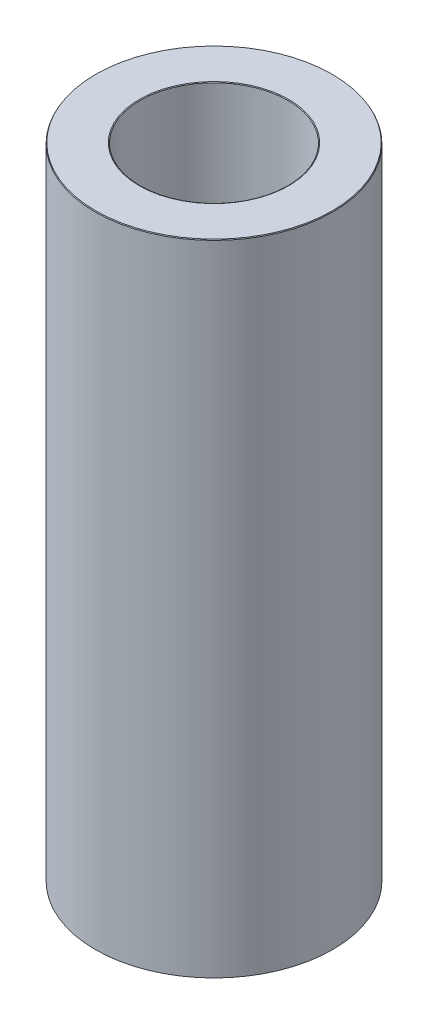
ISO-10303-21;
HEADER;
FILE_DESCRIPTION(('STEP AP214'),'2;1');
FILE_NAME('part.step','',(''),(''),'','','');
FILE_SCHEMA(('AUTOMOTIVE_DESIGN { 1 0 10303 214 1 1 1 1 }'));
ENDSEC;
DATA;
#1=APPLICATION_CONTEXT('core data for automotive mechanical design processes');
#2=APPLICATION_PROTOCOL_DEFINITION('international standard','automotive_design',2000,#1);
#3=PRODUCT_CONTEXT('',#1,'mechanical');
#4=PRODUCT('Part','Part','',(#3));
#5=PRODUCT_RELATED_PRODUCT_CATEGORY('part','',(#4));
#6=PRODUCT_DEFINITION_FORMATION('','',#4);
#7=PRODUCT_DEFINITION_CONTEXT('part definition',#1,'design');
#8=PRODUCT_DEFINITION('design','',#6,#7);
#9=PRODUCT_DEFINITION_SHAPE('','',#8);
#10=(LENGTH_UNIT() NAMED_UNIT(*) SI_UNIT(.MILLI.,.METRE.));
#11=(NAMED_UNIT(*) PLANE_ANGLE_UNIT() SI_UNIT($,.RADIAN.));
#12=(NAMED_UNIT(*) SI_UNIT($,.STERADIAN.) SOLID_ANGLE_UNIT());
#13=UNCERTAINTY_MEASURE_WITH_UNIT(LENGTH_MEASURE(1.E-05),#10,'distance_accuracy_value','');
#14=(GEOMETRIC_REPRESENTATION_CONTEXT(3) GLOBAL_UNCERTAINTY_ASSIGNED_CONTEXT((#13)) GLOBAL_UNIT_ASSIGNED_CONTEXT((#10,
#11,#12)) REPRESENTATION_CONTEXT('',''));
#15=CARTESIAN_POINT('',(0.,0.,0.));
#16=DIRECTION('',(0.,0.,1.));
#17=DIRECTION('',(1.,0.,0.));
#18=AXIS2_PLACEMENT_3D('',#15,#16,#17);
#19=CARTESIAN_POINT('',(0.,215.604779690848,0.));
#20=DIRECTION('',(0.,-1.,0.));
#21=DIRECTION('',(0.,0.,-1.));
#22=AXIS2_PLACEMENT_3D('',#19,#20,#21);
#23=CYLINDRICAL_SURFACE('',#22,40.);
#24=CARTESIAN_POINT('',(0.,0.157871731963771,0.));
#25=DIRECTION('',(0.,1.,0.));
#26=DIRECTION('',(0.,0.,1.));
#27=AXIS2_PLACEMENT_3D('',#24,#25,#26);
#28=CIRCLE('',#27,40.);
#29=CARTESIAN_POINT('',(0.,0.157871731963743,-40.));
#30=VERTEX_POINT('',#29);
#31=EDGE_CURVE('E10',#30,#30,#28,.T.);
#32=CARTESIAN_POINT('',(0.,215.331337830009,0.));
#33=DIRECTION('',(0.,1.,0.));
#34=DIRECTION('',(0.,0.,1.));
#35=AXIS2_PLACEMENT_3D('',#32,#33,#34);
#36=CIRCLE('',#35,40.);
#37=CARTESIAN_POINT('',(0.,215.331337830009,-40.));
#38=VERTEX_POINT('',#37);
#39=EDGE_CURVE('E50',#38,#38,#36,.F.);
#40=CARTESIAN_POINT('',(0.,0.157871731963743,-40.));
#41=CARTESIAN_POINT('',(0.,2.39926200381838,-40.));
#42=CARTESIAN_POINT('',(0.,4.64065227567301,-40.));
#43=CARTESIAN_POINT('',(0.,9.12343281938227,-40.));
#44=CARTESIAN_POINT('',(0.,11.3648230912369,-40.));
#45=CARTESIAN_POINT('',(0.,15.8476036349462,-40.));
#46=CARTESIAN_POINT('',(0.,18.0889939068008,-40.));
#47=CARTESIAN_POINT('',(0.,22.5717744505101,-40.));
#48=CARTESIAN_POINT('',(0.,24.8131647223647,-40.));
#49=CARTESIAN_POINT('',(0.,29.295945266074,-40.));
#50=CARTESIAN_POINT('',(0.,31.5373355379286,-40.));
#51=CARTESIAN_POINT('',(0.,36.0201160816379,-40.));
#52=CARTESIAN_POINT('',(0.,38.2615063534925,-40.));
#53=CARTESIAN_POINT('',(0.,42.7442868972018,-40.));
#54=CARTESIAN_POINT('',(0.,44.9856771690564,-40.));
#55=CARTESIAN_POINT('',(0.,49.4684577127657,-40.));
#56=CARTESIAN_POINT('',(0.,51.7098479846203,-40.));
#57=CARTESIAN_POINT('',(0.,56.1926285283296,-40.));
#58=CARTESIAN_POINT('',(0.,58.4340188001842,-40.));
#59=CARTESIAN_POINT('',(0.,62.9167993438935,-40.));
#60=CARTESIAN_POINT('',(0.,65.1581896157481,-40.));
#61=CARTESIAN_POINT('',(0.,69.6409701594574,-40.));
#62=CARTESIAN_POINT('',(0.,71.882360431312,-40.));
#63=CARTESIAN_POINT('',(0.,76.3651409750213,-40.));
#64=CARTESIAN_POINT('',(0.,78.6065312468759,-40.));
#65=CARTESIAN_POINT('',(0.,83.0893117905852,-40.));
#66=CARTESIAN_POINT('',(0.,85.3307020624398,-40.));
#67=CARTESIAN_POINT('',(0.,89.8134826061491,-40.));
#68=CARTESIAN_POINT('',(0.,92.0548728780037,-40.));
#69=CARTESIAN_POINT('',(0.,96.537653421713,-40.));
#70=CARTESIAN_POINT('',(0.,98.7790436935676,-40.));
#71=CARTESIAN_POINT('',(0.,103.261824237277,-40.));
#72=CARTESIAN_POINT('',(0.,105.503214509132,-40.));
#73=CARTESIAN_POINT('',(0.,109.985995052841,-40.));
#74=CARTESIAN_POINT('',(0.,112.227385324695,-40.));
#75=CARTESIAN_POINT('',(0.,116.710165868405,-40.));
#76=CARTESIAN_POINT('',(0.,118.951556140259,-40.));
#77=CARTESIAN_POINT('',(0.,123.434336683969,-40.));
#78=CARTESIAN_POINT('',(0.,125.675726955823,-40.));
#79=CARTESIAN_POINT('',(0.,130.158507499532,-40.));
#80=CARTESIAN_POINT('',(0.,132.399897771387,-40.));
#81=CARTESIAN_POINT('',(0.,136.882678315096,-40.));
#82=CARTESIAN_POINT('',(0.,139.124068586951,-40.));
#83=CARTESIAN_POINT('',(0.,143.60684913066,-40.));
#84=CARTESIAN_POINT('',(0.,145.848239402515,-40.));
#85=CARTESIAN_POINT('',(0.,150.331019946224,-40.));
#86=CARTESIAN_POINT('',(0.,152.572410218079,-40.));
#87=CARTESIAN_POINT('',(0.,157.055190761788,-40.));
#88=CARTESIAN_POINT('',(0.,159.296581033643,-40.));
#89=CARTESIAN_POINT('',(0.,163.779361577352,-40.));
#90=CARTESIAN_POINT('',(0.,166.020751849207,-40.));
#91=CARTESIAN_POINT('',(0.,170.503532392916,-40.));
#92=CARTESIAN_POINT('',(0.,172.744922664771,-40.));
#93=CARTESIAN_POINT('',(0.,177.22770320848,-40.));
#94=CARTESIAN_POINT('',(0.,179.469093480334,-40.));
#95=CARTESIAN_POINT('',(0.,183.951874024044,-40.));
#96=CARTESIAN_POINT('',(0.,186.193264295898,-40.));
#97=CARTESIAN_POINT('',(0.,190.676044839608,-40.));
#98=CARTESIAN_POINT('',(0.,192.917435111462,-40.));
#99=CARTESIAN_POINT('',(0.,197.400215655171,-40.));
#100=CARTESIAN_POINT('',(0.,199.641605927026,-40.));
#101=CARTESIAN_POINT('',(0.,204.124386470735,-40.));
#102=CARTESIAN_POINT('',(0.,206.36577674259,-40.));
#103=CARTESIAN_POINT('',(0.,210.848557286299,-40.));
#104=CARTESIAN_POINT('',(0.,213.089947558154,-40.));
#105=CARTESIAN_POINT('',(0.,215.331337830009,-40.));
#106=B_SPLINE_CURVE_WITH_KNOTS('',3,(#40,#41,#42,#43,#44,#45,#46,#47,#48,#49,#50,#51,#52,#53,
#54,#55,#56,#57,#58,#59,#60,#61,#62,#63,#64,#65,#66,#67,#68,#69,#70,#71,#72,#73,#74,#75,#76,#77,
#78,#79,#80,#81,#82,#83,#84,#85,#86,#87,#88,#89,#90,#91,#92,#93,#94,#95,#96,#97,#98,#99,#100,
#101,#102,#103,#104,#105),.UNSPECIFIED.,.F.,.F.,(4,2,2,2,2,2,2,2,2,2,2,2,2,2,2,2,2,2,2,2,2,2,2,
2,2,2,2,2,2,2,2,2,4),(0.,6.7241708155639,13.4483416311278,20.1725124466917,26.8966832622556,
33.6208540778195,40.3450248933834,47.0691957089473,53.7933665245112,60.5175373400751,
67.241708155639,73.9658789712029,80.6900497867668,87.4142206023307,94.1383914178946,
100.862562233459,107.586733049022,114.310903864586,121.03507468015,127.759245495714,
134.483416311278,141.207587126842,147.931757942406,154.65592875797,161.380099573534,
168.104270389098,174.828441204661,181.552612020225,188.276782835789,195.000953651353,
201.725124466917,208.449295282481,215.173466098045),.UNSPECIFIED.);
#107=EDGE_CURVE('BSEAM39',#30,#38,#106,.T.);
#108=ORIENTED_EDGE('',*,*,#31,.T.);
#109=ORIENTED_EDGE('',*,*,#39,.T.);
#110=ORIENTED_EDGE('',*,*,#107,.T.);
#111=ORIENTED_EDGE('',*,*,#107,.F.);
#112=EDGE_LOOP('',(#108,#110,#109,#111));
#113=FACE_BOUND('',#112,.T.);
#114=ADVANCED_FACE('F39',(#113),#23,.T.);
#115=CARTESIAN_POINT('',(0.,215.604779690848,0.));
#116=DIRECTION('',(0.,1.,0.));
#117=DIRECTION('',(0.,0.,1.));
#118=AXIS2_PLACEMENT_3D('',#115,#116,#117);
#119=PLANE('',#118);
#120=CARTESIAN_POINT('',(0.,215.604779690848,0.));
#121=DIRECTION('',(0.,1.,0.));
#122=DIRECTION('',(0.,0.,1.));
#123=AXIS2_PLACEMENT_3D('',#120,#121,#122);
#124=CIRCLE('',#123,25.1826020037234);
#125=CARTESIAN_POINT('',(0.,215.604779690848,25.1826020037234));
#126=VERTEX_POINT('',#125);
#127=EDGE_CURVE('E58',#126,#126,#124,.F.);
#128=ORIENTED_EDGE('',*,*,#127,.T.);
#129=EDGE_LOOP('',(#128));
#130=FACE_BOUND('',#129,.T.);
#131=CARTESIAN_POINT('',(0.,215.604779690848,0.));
#132=DIRECTION('',(0.,1.,0.));
#133=DIRECTION('',(0.,0.,1.));
#134=AXIS2_PLACEMENT_3D('',#131,#132,#133);
#135=CIRCLE('',#134,39.8421282680364);
#136=CARTESIAN_POINT('',(0.,215.604779690848,39.8421282680364));
#137=VERTEX_POINT('',#136);
#138=EDGE_CURVE('E61',#137,#137,#135,.T.);
#139=ORIENTED_EDGE('',*,*,#138,.T.);
#140=EDGE_LOOP('',(#139));
#141=FACE_BOUND('',#140,.T.);
#142=ADVANCED_FACE('F88',(#130,#141),#119,.T.);
#143=CARTESIAN_POINT('',(0.,0.,0.));
#144=DIRECTION('',(0.,1.,0.));
#145=DIRECTION('',(0.,0.,1.));
#146=AXIS2_PLACEMENT_3D('',#143,#144,#145);
#147=PLANE('',#146);
#148=CARTESIAN_POINT('',(0.,0.,0.));
#149=DIRECTION('',(0.,1.,0.));
#150=DIRECTION('',(0.,0.,1.));
#151=AXIS2_PLACEMENT_3D('',#148,#149,#150);
#152=CIRCLE('',#151,25.067031874847);
#153=CARTESIAN_POINT('',(0.,0.,25.067031874847));
#154=VERTEX_POINT('',#153);
#155=EDGE_CURVE('E51',#154,#154,#152,.T.);
#156=ORIENTED_EDGE('',*,*,#155,.T.);
#157=EDGE_LOOP('',(#156));
#158=FACE_BOUND('',#157,.T.);
#159=CARTESIAN_POINT('',(0.,0.,0.));
#160=DIRECTION('',(0.,1.,0.));
#161=DIRECTION('',(0.,0.,1.));
#162=AXIS2_PLACEMENT_3D('',#159,#160,#161);
#163=CIRCLE('',#162,39.7265581391599);
#164=CARTESIAN_POINT('',(0.,0.,39.7265581391599));
#165=VERTEX_POINT('',#164);
#166=EDGE_CURVE('E54',#165,#165,#163,.F.);
#167=ORIENTED_EDGE('',*,*,#166,.T.);
#168=EDGE_LOOP('',(#167));
#169=FACE_BOUND('',#168,.T.);
#170=ADVANCED_FACE('F83',(#158,#169),#147,.F.);
#171=CARTESIAN_POINT('',(0.,215.604779690848,0.));
#172=DIRECTION('',(0.,-1.,0.));
#173=DIRECTION('',(0.,0.,-1.));
#174=AXIS2_PLACEMENT_3D('',#171,#172,#173);
#175=CYLINDRICAL_SURFACE('',#174,24.9091601428833);
#176=CARTESIAN_POINT('',(0.,215.446907958885,0.));
#177=DIRECTION('',(0.,1.,0.));
#178=DIRECTION('',(0.,0.,1.));
#179=AXIS2_PLACEMENT_3D('',#176,#177,#178);
#180=CIRCLE('',#179,24.9091601428833);
#181=CARTESIAN_POINT('',(0.,215.446907958885,-24.9091601428833));
#182=VERTEX_POINT('',#181);
#183=EDGE_CURVE('E67',#182,#182,#180,.T.);
#184=CARTESIAN_POINT('',(0.,0.273441860840051,0.));
#185=DIRECTION('',(0.,1.,0.));
#186=DIRECTION('',(0.,0.,1.));
#187=AXIS2_PLACEMENT_3D('',#184,#185,#186);
#188=CIRCLE('',#187,24.9091601428833);
#189=CARTESIAN_POINT('',(0.,0.273441860840051,-24.9091601428833));
#190=VERTEX_POINT('',#189);
#191=EDGE_CURVE('E69',#190,#190,#188,.F.);
#192=CARTESIAN_POINT('',(0.,215.446907958885,-24.9091601428833));
#193=CARTESIAN_POINT('',(0.,213.20551768703,-24.9091601428833));
#194=CARTESIAN_POINT('',(0.,210.964127415175,-24.9091601428833));
#195=CARTESIAN_POINT('',(0.,206.481346871466,-24.9091601428833));
#196=CARTESIAN_POINT('',(0.,204.239956599611,-24.9091601428833));
#197=CARTESIAN_POINT('',(0.,199.757176055902,-24.9091601428833));
#198=CARTESIAN_POINT('',(0.,197.515785784048,-24.9091601428833));
#199=CARTESIAN_POINT('',(0.,193.033005240338,-24.9091601428833));
#200=CARTESIAN_POINT('',(0.,190.791614968484,-24.9091601428833));
#201=CARTESIAN_POINT('',(0.,186.308834424774,-24.9091601428833));
#202=CARTESIAN_POINT('',(0.,184.06744415292,-24.9091601428833));
#203=CARTESIAN_POINT('',(0.,179.58466360921,-24.9091601428833));
#204=CARTESIAN_POINT('',(0.,177.343273337356,-24.9091601428833));
#205=CARTESIAN_POINT('',(0.,172.860492793647,-24.9091601428833));
#206=CARTESIAN_POINT('',(0.,170.619102521792,-24.9091601428833));
#207=CARTESIAN_POINT('',(0.,166.136321978083,-24.9091601428833));
#208=CARTESIAN_POINT('',(0.,163.894931706228,-24.9091601428833));
#209=CARTESIAN_POINT('',(0.,159.412151162519,-24.9091601428833));
#210=CARTESIAN_POINT('',(0.,157.170760890664,-24.9091601428833));
#211=CARTESIAN_POINT('',(0.,152.687980346955,-24.9091601428833));
#212=CARTESIAN_POINT('',(0.,150.4465900751,-24.9091601428833));
#213=CARTESIAN_POINT('',(0.,145.963809531391,-24.9091601428833));
#214=CARTESIAN_POINT('',(0.,143.722419259536,-24.9091601428833));
#215=CARTESIAN_POINT('',(0.,139.239638715827,-24.9091601428833));
#216=CARTESIAN_POINT('',(0.,136.998248443973,-24.9091601428833));
#217=CARTESIAN_POINT('',(0.,132.515467900263,-24.9091601428833));
#218=CARTESIAN_POINT('',(0.,130.274077628409,-24.9091601428833));
#219=CARTESIAN_POINT('',(0.,125.791297084699,-24.9091601428833));
#220=CARTESIAN_POINT('',(0.,123.549906812845,-24.9091601428833));
#221=CARTESIAN_POINT('',(0.,119.067126269135,-24.9091601428833));
#222=CARTESIAN_POINT('',(0.,116.825735997281,-24.9091601428833));
#223=CARTESIAN_POINT('',(0.,112.342955453572,-24.9091601428833));
#224=CARTESIAN_POINT('',(0.,110.101565181717,-24.9091601428833));
#225=CARTESIAN_POINT('',(0.,105.618784638008,-24.9091601428833));
#226=CARTESIAN_POINT('',(0.,103.377394366153,-24.9091601428833));
#227=CARTESIAN_POINT('',(0.,98.8946138224438,-24.9091601428833));
#228=CARTESIAN_POINT('',(0.,96.6532235505892,-24.9091601428833));
#229=CARTESIAN_POINT('',(0.,92.1704430068799,-24.9091601428833));
#230=CARTESIAN_POINT('',(0.,89.9290527350253,-24.9091601428833));
#231=CARTESIAN_POINT('',(0.,85.446272191316,-24.9091601428833));
#232=CARTESIAN_POINT('',(0.,83.2048819194614,-24.9091601428833));
#233=CARTESIAN_POINT('',(0.,78.7221013757521,-24.9091601428833));
#234=CARTESIAN_POINT('',(0.,76.4807111038975,-24.9091601428833));
#235=CARTESIAN_POINT('',(0.,71.9979305601883,-24.9091601428833));
#236=CARTESIAN_POINT('',(0.,69.7565402883336,-24.9091601428833));
#237=CARTESIAN_POINT('',(0.,65.2737597446243,-24.9091601428833));
#238=CARTESIAN_POINT('',(0.,63.0323694727697,-24.9091601428833));
#239=CARTESIAN_POINT('',(0.,58.5495889290605,-24.9091601428833));
#240=CARTESIAN_POINT('',(0.,56.3081986572058,-24.9091601428833));
#241=CARTESIAN_POINT('',(0.,51.8254181134966,-24.9091601428833));
#242=CARTESIAN_POINT('',(0.,49.5840278416419,-24.9091601428833));
#243=CARTESIAN_POINT('',(0.,45.1012472979327,-24.9091601428833));
#244=CARTESIAN_POINT('',(0.,42.859857026078,-24.9091601428833));
#245=CARTESIAN_POINT('',(0.,38.3770764823688,-24.9091601428833));
#246=CARTESIAN_POINT('',(0.,36.1356862105141,-24.9091601428833));
#247=CARTESIAN_POINT('',(0.,31.6529056668049,-24.9091601428833));
#248=CARTESIAN_POINT('',(0.,29.4115153949503,-24.9091601428833));
#249=CARTESIAN_POINT('',(0.,24.928734851241,-24.9091601428833));
#250=CARTESIAN_POINT('',(0.,22.6873445793864,-24.9091601428833));
#251=CARTESIAN_POINT('',(0.,18.2045640356771,-24.9091601428833));
#252=CARTESIAN_POINT('',(0.,15.9631737638225,-24.9091601428833));
#253=CARTESIAN_POINT('',(0.,11.4803932201132,-24.9091601428833));
#254=CARTESIAN_POINT('',(0.,9.23900294825858,-24.9091601428833));
#255=CARTESIAN_POINT('',(0.,4.75622240454931,-24.9091601428833));
#256=CARTESIAN_POINT('',(0.,2.51483213269468,-24.9091601428833));
#257=CARTESIAN_POINT('',(0.,0.273441860840051,-24.9091601428833));
#258=B_SPLINE_CURVE_WITH_KNOTS('',3,(#192,#193,#194,#195,#196,#197,#198,#199,#200,#201,#202,
#203,#204,#205,#206,#207,#208,#209,#210,#211,#212,#213,#214,#215,#216,#217,#218,#219,#220,#221,
#222,#223,#224,#225,#226,#227,#228,#229,#230,#231,#232,#233,#234,#235,#236,#237,#238,#239,#240,
#241,#242,#243,#244,#245,#246,#247,#248,#249,#250,#251,#252,#253,#254,#255,#256,#257),
.UNSPECIFIED.,.F.,.F.,(4,2,2,2,2,2,2,2,2,2,2,2,2,2,2,2,2,2,2,2,2,2,2,2,2,2,2,2,2,2,2,2,4),(0.,
6.72417081556387,13.4483416311278,20.1725124466917,26.8966832622556,33.6208540778195,
40.3450248933833,47.0691957089472,53.7933665245111,60.517537340075,67.2417081556389,
73.9658789712028,80.6900497867667,87.4142206023306,94.1383914178945,100.862562233458,
107.586733049022,114.310903864586,121.03507468015,127.759245495714,134.483416311278,
141.207587126842,147.931757942406,154.655928757969,161.380099573533,168.104270389097,
174.828441204661,181.552612020225,188.276782835789,195.000953651353,201.725124466917,
208.449295282481,215.173466098045),.UNSPECIFIED.);
#259=EDGE_CURVE('BSEAM71',#182,#190,#258,.T.);
#260=ORIENTED_EDGE('',*,*,#183,.T.);
#261=ORIENTED_EDGE('',*,*,#191,.T.);
#262=ORIENTED_EDGE('',*,*,#259,.T.);
#263=ORIENTED_EDGE('',*,*,#259,.F.);
#264=EDGE_LOOP('',(#260,#262,#261,#263));
#265=FACE_BOUND('',#264,.T.);
#266=ADVANCED_FACE('F71',(#265),#175,.F.);
#267=CARTESIAN_POINT('',(0.,215.446907958885,0.));
#268=DIRECTION('',(0.,1.,0.));
#269=DIRECTION('',(0.,0.,1.));
#270=AXIS2_PLACEMENT_3D('',#267,#268,#269);
#271=CONICAL_SURFACE('',#270,24.9091601428833,1.0471975511966);
#272=ORIENTED_EDGE('',*,*,#127,.F.);
#273=EDGE_LOOP('',(#272));
#274=FACE_BOUND('',#273,.T.);
#275=ORIENTED_EDGE('',*,*,#183,.F.);
#276=EDGE_LOOP('',(#275));
#277=FACE_BOUND('',#276,.T.);
#278=ADVANCED_FACE('F77',(#274,#277),#271,.F.);
#279=CARTESIAN_POINT('',(0.,0.,0.));
#280=DIRECTION('',(0.,-1.,0.));
#281=DIRECTION('',(0.,0.,-1.));
#282=AXIS2_PLACEMENT_3D('',#279,#280,#281);
#283=CONICAL_SURFACE('',#282,25.067031874847,0.523598775598318);
#284=ORIENTED_EDGE('',*,*,#191,.F.);
#285=EDGE_LOOP('',(#284));
#286=FACE_BOUND('',#285,.T.);
#287=ORIENTED_EDGE('',*,*,#155,.F.);
#288=EDGE_LOOP('',(#287));
#289=FACE_BOUND('',#288,.T.);
#290=ADVANCED_FACE('F73',(#286,#289),#283,.F.);
#291=CARTESIAN_POINT('',(0.,0.157871731963771,0.));
#292=DIRECTION('',(0.,1.,0.));
#293=DIRECTION('',(0.,0.,1.));
#294=AXIS2_PLACEMENT_3D('',#291,#292,#293);
#295=CONICAL_SURFACE('',#294,40.,1.04719755119657);
#296=ORIENTED_EDGE('',*,*,#166,.F.);
#297=EDGE_LOOP('',(#296));
#298=FACE_BOUND('',#297,.T.);
#299=ORIENTED_EDGE('',*,*,#31,.F.);
#300=EDGE_LOOP('',(#299));
#301=FACE_BOUND('',#300,.T.);
#302=ADVANCED_FACE('F76',(#298,#301),#295,.T.);
#303=CARTESIAN_POINT('',(0.,215.604779690848,0.));
#304=DIRECTION('',(0.,-1.,0.));
#305=DIRECTION('',(0.,0.,-1.));
#306=AXIS2_PLACEMENT_3D('',#303,#304,#305);
#307=CONICAL_SURFACE('',#306,39.8421282680364,0.523598775598257);
#308=ORIENTED_EDGE('',*,*,#39,.F.);
#309=EDGE_LOOP('',(#308));
#310=FACE_BOUND('',#309,.T.);
#311=ORIENTED_EDGE('',*,*,#138,.F.);
#312=EDGE_LOOP('',(#311));
#313=FACE_BOUND('',#312,.T.);
#314=ADVANCED_FACE('F45',(#310,#313),#307,.T.);
#315=CLOSED_SHELL('',(#114,#142,#170,#266,#278,#290,#302,#314));
#316=MANIFOLD_SOLID_BREP('B2',#315);
#317=ADVANCED_BREP_SHAPE_REPRESENTATION('',(#18,#316),#14);
#318=SHAPE_DEFINITION_REPRESENTATION(#9,#317);
ENDSEC;
END-ISO-10303-21;
